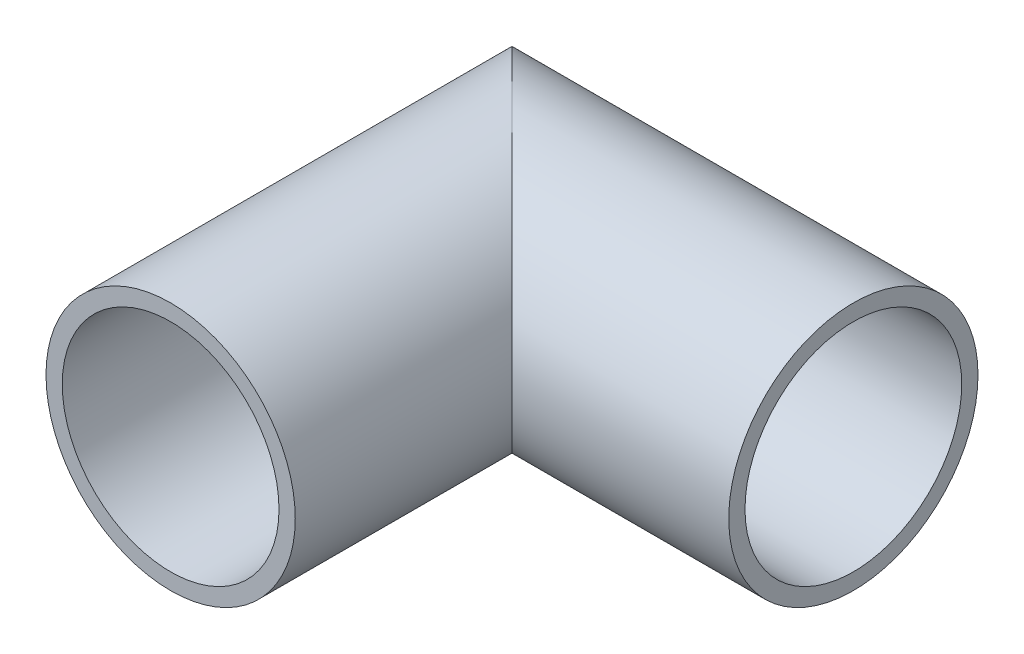
ISO-10303-21;
HEADER;
FILE_DESCRIPTION(('STEP AP214'),'2;1');
FILE_NAME('part.step','',(''),(''),'','','');
FILE_SCHEMA(('AUTOMOTIVE_DESIGN { 1 0 10303 214 1 1 1 1 }'));
ENDSEC;
DATA;
#1=APPLICATION_CONTEXT('core data for automotive mechanical design processes');
#2=APPLICATION_PROTOCOL_DEFINITION('international standard','automotive_design',2000,#1);
#3=PRODUCT_CONTEXT('',#1,'mechanical');
#4=PRODUCT('Part','Part','',(#3));
#5=PRODUCT_RELATED_PRODUCT_CATEGORY('part','',(#4));
#6=PRODUCT_DEFINITION_FORMATION('','',#4);
#7=PRODUCT_DEFINITION_CONTEXT('part definition',#1,'design');
#8=PRODUCT_DEFINITION('design','',#6,#7);
#9=PRODUCT_DEFINITION_SHAPE('','',#8);
#10=(LENGTH_UNIT() NAMED_UNIT(*) SI_UNIT(.MILLI.,.METRE.));
#11=(NAMED_UNIT(*) PLANE_ANGLE_UNIT() SI_UNIT($,.RADIAN.));
#12=(NAMED_UNIT(*) SI_UNIT($,.STERADIAN.) SOLID_ANGLE_UNIT());
#13=UNCERTAINTY_MEASURE_WITH_UNIT(LENGTH_MEASURE(1.E-05),#10,'distance_accuracy_value','');
#14=(GEOMETRIC_REPRESENTATION_CONTEXT(3) GLOBAL_UNCERTAINTY_ASSIGNED_CONTEXT((#13)) GLOBAL_UNIT_ASSIGNED_CONTEXT((#10,
#11,#12)) REPRESENTATION_CONTEXT('',''));
#15=CARTESIAN_POINT('',(0.,0.,0.));
#16=DIRECTION('',(0.,0.,1.));
#17=DIRECTION('',(1.,0.,0.));
#18=AXIS2_PLACEMENT_3D('',#15,#16,#17);
#19=CARTESIAN_POINT('',(0.,0.,40.005));
#20=DIRECTION('',(0.,0.,-1.));
#21=DIRECTION('',(-1.,0.,0.));
#22=AXIS2_PLACEMENT_3D('',#19,#20,#21);
#23=CYLINDRICAL_SURFACE('',#22,14.605);
#24=CARTESIAN_POINT('',(0.,0.,0.));
#25=DIRECTION('',(0.707106781186547,0.,-0.707106781186547));
#26=DIRECTION('',(-0.707106781186547,0.,-0.707106781186547));
#27=AXIS2_PLACEMENT_3D('',#24,#25,#26);
#28=ELLIPSE('',#27,20.654589078459,14.605);
#29=CARTESIAN_POINT('',(-14.605,0.,-14.605));
#30=VERTEX_POINT('',#29);
#31=EDGE_CURVE('E41',#30,#30,#28,.T.);
#32=ORIENTED_EDGE('',*,*,#31,.F.);
#33=EDGE_LOOP('',(#32));
#34=FACE_BOUND('',#33,.T.);
#35=CARTESIAN_POINT('',(0.,0.,40.005));
#36=DIRECTION('',(0.,0.,1.));
#37=DIRECTION('',(1.,0.,0.));
#38=AXIS2_PLACEMENT_3D('',#35,#36,#37);
#39=CIRCLE('',#38,14.605);
#40=CARTESIAN_POINT('',(14.605,0.,40.005));
#41=VERTEX_POINT('',#40);
#42=EDGE_CURVE('E10',#41,#41,#39,.T.);
#43=ORIENTED_EDGE('',*,*,#42,.F.);
#44=EDGE_LOOP('',(#43));
#45=FACE_BOUND('',#44,.T.);
#46=ADVANCED_FACE('F35',(#34,#45),#23,.T.);
#47=CARTESIAN_POINT('',(0.,0.,40.005));
#48=DIRECTION('',(0.,0.,1.));
#49=DIRECTION('',(1.,0.,0.));
#50=AXIS2_PLACEMENT_3D('',#47,#48,#49);
#51=PLANE('',#50);
#52=CARTESIAN_POINT('',(0.,0.,40.005));
#53=DIRECTION('',(0.,0.,1.));
#54=DIRECTION('',(1.,0.,0.));
#55=AXIS2_PLACEMENT_3D('',#52,#53,#54);
#56=CIRCLE('',#55,12.7);
#57=CARTESIAN_POINT('',(12.7,0.,40.005));
#58=VERTEX_POINT('',#57);
#59=EDGE_CURVE('E49',#58,#58,#56,.T.);
#60=ORIENTED_EDGE('',*,*,#59,.F.);
#61=EDGE_LOOP('',(#60));
#62=FACE_BOUND('',#61,.T.);
#63=ORIENTED_EDGE('',*,*,#42,.T.);
#64=EDGE_LOOP('',(#63));
#65=FACE_BOUND('',#64,.T.);
#66=ADVANCED_FACE('F73',(#62,#65),#51,.T.);
#67=CARTESIAN_POINT('',(40.005,0.,0.));
#68=DIRECTION('',(-1.,0.,0.));
#69=DIRECTION('',(0.,0.,1.));
#70=AXIS2_PLACEMENT_3D('',#67,#68,#69);
#71=CYLINDRICAL_SURFACE('',#70,14.605);
#72=CARTESIAN_POINT('',(40.005,0.,0.));
#73=DIRECTION('',(1.,0.,0.));
#74=DIRECTION('',(0.,0.,-1.));
#75=AXIS2_PLACEMENT_3D('',#72,#73,#74);
#76=CIRCLE('',#75,14.605);
#77=CARTESIAN_POINT('',(40.005,0.,-14.605));
#78=VERTEX_POINT('',#77);
#79=EDGE_CURVE('E45',#78,#78,#76,.T.);
#80=ORIENTED_EDGE('',*,*,#79,.F.);
#81=EDGE_LOOP('',(#80));
#82=FACE_BOUND('',#81,.T.);
#83=ORIENTED_EDGE('',*,*,#31,.T.);
#84=EDGE_LOOP('',(#83));
#85=FACE_BOUND('',#84,.T.);
#86=ADVANCED_FACE('F68',(#82,#85),#71,.T.);
#87=CARTESIAN_POINT('',(40.005,0.,0.));
#88=DIRECTION('',(1.,0.,0.));
#89=DIRECTION('',(0.,0.,-1.));
#90=AXIS2_PLACEMENT_3D('',#87,#88,#89);
#91=PLANE('',#90);
#92=CARTESIAN_POINT('',(40.005,0.,0.));
#93=DIRECTION('',(1.,0.,0.));
#94=DIRECTION('',(0.,0.,-1.));
#95=AXIS2_PLACEMENT_3D('',#92,#93,#94);
#96=CIRCLE('',#95,12.7);
#97=CARTESIAN_POINT('',(40.005,0.,-12.7));
#98=VERTEX_POINT('',#97);
#99=EDGE_CURVE('E57',#98,#98,#96,.T.);
#100=ORIENTED_EDGE('',*,*,#99,.F.);
#101=EDGE_LOOP('',(#100));
#102=FACE_BOUND('',#101,.T.);
#103=ORIENTED_EDGE('',*,*,#79,.T.);
#104=EDGE_LOOP('',(#103));
#105=FACE_BOUND('',#104,.T.);
#106=ADVANCED_FACE('F64',(#102,#105),#91,.T.);
#107=CARTESIAN_POINT('',(0.,0.,0.));
#108=DIRECTION('',(0.,0.,1.));
#109=DIRECTION('',(1.,0.,0.));
#110=AXIS2_PLACEMENT_3D('',#107,#108,#109);
#111=CYLINDRICAL_SURFACE('',#110,12.7);
#112=CARTESIAN_POINT('',(0.,0.,0.));
#113=DIRECTION('',(-0.707106781186547,0.,0.707106781186547));
#114=DIRECTION('',(0.707106781186547,0.,0.707106781186547));
#115=AXIS2_PLACEMENT_3D('',#112,#113,#114);
#116=ELLIPSE('',#115,17.9605122421383,12.7);
#117=CARTESIAN_POINT('',(12.7,0.,12.7));
#118=VERTEX_POINT('',#117);
#119=EDGE_CURVE('E54',#118,#118,#116,.F.);
#120=ORIENTED_EDGE('',*,*,#119,.T.);
#121=EDGE_LOOP('',(#120));
#122=FACE_BOUND('',#121,.T.);
#123=ORIENTED_EDGE('',*,*,#59,.T.);
#124=EDGE_LOOP('',(#123));
#125=FACE_BOUND('',#124,.T.);
#126=ADVANCED_FACE('F67',(#122,#125),#111,.F.);
#127=CARTESIAN_POINT('',(0.,0.,0.));
#128=DIRECTION('',(1.,0.,0.));
#129=DIRECTION('',(0.,0.,-1.));
#130=AXIS2_PLACEMENT_3D('',#127,#128,#129);
#131=CYLINDRICAL_SURFACE('',#130,12.7);
#132=ORIENTED_EDGE('',*,*,#99,.T.);
#133=EDGE_LOOP('',(#132));
#134=FACE_BOUND('',#133,.T.);
#135=ORIENTED_EDGE('',*,*,#119,.F.);
#136=EDGE_LOOP('',(#135));
#137=FACE_BOUND('',#136,.T.);
#138=ADVANCED_FACE('F61',(#134,#137),#131,.F.);
#139=CLOSED_SHELL('',(#46,#66,#86,#106,#126,#138));
#140=MANIFOLD_SOLID_BREP('B2',#139);
#141=ADVANCED_BREP_SHAPE_REPRESENTATION('',(#18,#140),#14);
#142=SHAPE_DEFINITION_REPRESENTATION(#9,#141);
ENDSEC;
END-ISO-10303-21;
